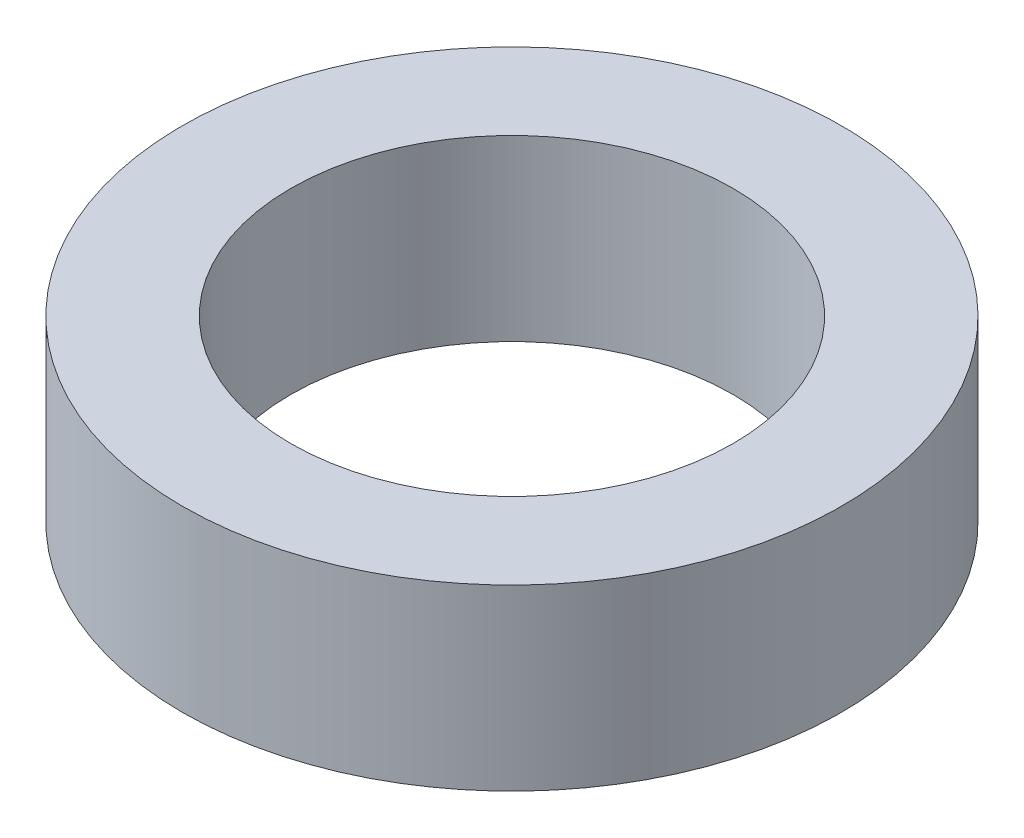
ISO-10303-21;
HEADER;
FILE_DESCRIPTION(('STEP AP214'),'2;1');
FILE_NAME('part.step','',(''),(''),'','','');
FILE_SCHEMA(('AUTOMOTIVE_DESIGN { 1 0 10303 214 1 1 1 1 }'));
ENDSEC;
DATA;
#1=APPLICATION_CONTEXT('core data for automotive mechanical design processes');
#2=APPLICATION_PROTOCOL_DEFINITION('international standard','automotive_design',2000,#1);
#3=PRODUCT_CONTEXT('',#1,'mechanical');
#4=PRODUCT('Part','Part','',(#3));
#5=PRODUCT_RELATED_PRODUCT_CATEGORY('part','',(#4));
#6=PRODUCT_DEFINITION_FORMATION('','',#4);
#7=PRODUCT_DEFINITION_CONTEXT('part definition',#1,'design');
#8=PRODUCT_DEFINITION('design','',#6,#7);
#9=PRODUCT_DEFINITION_SHAPE('','',#8);
#10=(LENGTH_UNIT() NAMED_UNIT(*) SI_UNIT(.MILLI.,.METRE.));
#11=(NAMED_UNIT(*) PLANE_ANGLE_UNIT() SI_UNIT($,.RADIAN.));
#12=(NAMED_UNIT(*) SI_UNIT($,.STERADIAN.) SOLID_ANGLE_UNIT());
#13=UNCERTAINTY_MEASURE_WITH_UNIT(LENGTH_MEASURE(1.E-05),#10,'distance_accuracy_value','');
#14=(GEOMETRIC_REPRESENTATION_CONTEXT(3) GLOBAL_UNCERTAINTY_ASSIGNED_CONTEXT((#13)) GLOBAL_UNIT_ASSIGNED_CONTEXT((#10,
#11,#12)) REPRESENTATION_CONTEXT('',''));
#15=CARTESIAN_POINT('',(0.,0.,0.));
#16=DIRECTION('',(0.,0.,1.));
#17=DIRECTION('',(1.,0.,0.));
#18=AXIS2_PLACEMENT_3D('',#15,#16,#17);
#19=CARTESIAN_POINT('',(0.,3.25,0.));
#20=DIRECTION('',(0.,1.,0.));
#21=DIRECTION('',(0.,0.,1.));
#22=AXIS2_PLACEMENT_3D('',#19,#20,#21);
#23=PLANE('',#22);
#24=CARTESIAN_POINT('',(0.,3.25,0.));
#25=DIRECTION('',(0.,1.,0.));
#26=DIRECTION('',(0.,0.,1.));
#27=AXIS2_PLACEMENT_3D('',#24,#25,#26);
#28=CIRCLE('',#27,6.);
#29=CARTESIAN_POINT('',(0.,3.25,6.));
#30=VERTEX_POINT('',#29);
#31=EDGE_CURVE('E10',#30,#30,#28,.T.);
#32=ORIENTED_EDGE('',*,*,#31,.T.);
#33=EDGE_LOOP('',(#32));
#34=FACE_BOUND('',#33,.T.);
#35=CARTESIAN_POINT('',(0.,3.25,0.));
#36=DIRECTION('',(0.,1.,0.));
#37=DIRECTION('',(0.,0.,1.));
#38=AXIS2_PLACEMENT_3D('',#35,#36,#37);
#39=CIRCLE('',#38,4.025);
#40=CARTESIAN_POINT('',(0.,3.25,4.025));
#41=VERTEX_POINT('',#40);
#42=EDGE_CURVE('E56',#41,#41,#39,.T.);
#43=ORIENTED_EDGE('',*,*,#42,.F.);
#44=EDGE_LOOP('',(#43));
#45=FACE_BOUND('',#44,.T.);
#46=ADVANCED_FACE('F43',(#34,#45),#23,.T.);
#47=CARTESIAN_POINT('',(0.,0.,0.));
#48=DIRECTION('',(0.,1.,0.));
#49=DIRECTION('',(0.,0.,1.));
#50=AXIS2_PLACEMENT_3D('',#47,#48,#49);
#51=PLANE('',#50);
#52=CARTESIAN_POINT('',(0.,0.,0.));
#53=DIRECTION('',(0.,1.,0.));
#54=DIRECTION('',(0.,0.,1.));
#55=AXIS2_PLACEMENT_3D('',#52,#53,#54);
#56=CIRCLE('',#55,6.);
#57=CARTESIAN_POINT('',(0.,0.,6.));
#58=VERTEX_POINT('',#57);
#59=EDGE_CURVE('E47',#58,#58,#56,.T.);
#60=ORIENTED_EDGE('',*,*,#59,.F.);
#61=EDGE_LOOP('',(#60));
#62=FACE_BOUND('',#61,.T.);
#63=CARTESIAN_POINT('',(0.,0.,0.));
#64=DIRECTION('',(0.,1.,0.));
#65=DIRECTION('',(0.,0.,1.));
#66=AXIS2_PLACEMENT_3D('',#63,#64,#65);
#67=CIRCLE('',#66,4.025);
#68=CARTESIAN_POINT('',(0.,0.,4.025));
#69=VERTEX_POINT('',#68);
#70=EDGE_CURVE('E58',#69,#69,#67,.T.);
#71=ORIENTED_EDGE('',*,*,#70,.T.);
#72=EDGE_LOOP('',(#71));
#73=FACE_BOUND('',#72,.T.);
#74=ADVANCED_FACE('F70',(#62,#73),#51,.F.);
#75=CARTESIAN_POINT('',(0.,3.25,0.));
#76=DIRECTION('',(0.,-1.,0.));
#77=DIRECTION('',(0.,0.,-1.));
#78=AXIS2_PLACEMENT_3D('',#75,#76,#77);
#79=CYLINDRICAL_SURFACE('',#78,6.);
#80=ORIENTED_EDGE('',*,*,#31,.F.);
#81=EDGE_LOOP('',(#80));
#82=FACE_BOUND('',#81,.T.);
#83=ORIENTED_EDGE('',*,*,#59,.T.);
#84=EDGE_LOOP('',(#83));
#85=FACE_BOUND('',#84,.T.);
#86=ADVANCED_FACE('F45',(#82,#85),#79,.T.);
#87=CARTESIAN_POINT('',(0.,3.25,0.));
#88=DIRECTION('',(0.,-1.,0.));
#89=DIRECTION('',(0.,0.,-1.));
#90=AXIS2_PLACEMENT_3D('',#87,#88,#89);
#91=CYLINDRICAL_SURFACE('',#90,4.025);
#92=ORIENTED_EDGE('',*,*,#42,.T.);
#93=EDGE_LOOP('',(#92));
#94=FACE_BOUND('',#93,.T.);
#95=ORIENTED_EDGE('',*,*,#70,.F.);
#96=EDGE_LOOP('',(#95));
#97=FACE_BOUND('',#96,.T.);
#98=ADVANCED_FACE('F66',(#94,#97),#91,.F.);
#99=CLOSED_SHELL('',(#46,#74,#86,#98));
#100=MANIFOLD_SOLID_BREP('B2',#99);
#101=ADVANCED_BREP_SHAPE_REPRESENTATION('',(#18,#100),#14);
#102=SHAPE_DEFINITION_REPRESENTATION(#9,#101);
ENDSEC;
END-ISO-10303-21;
